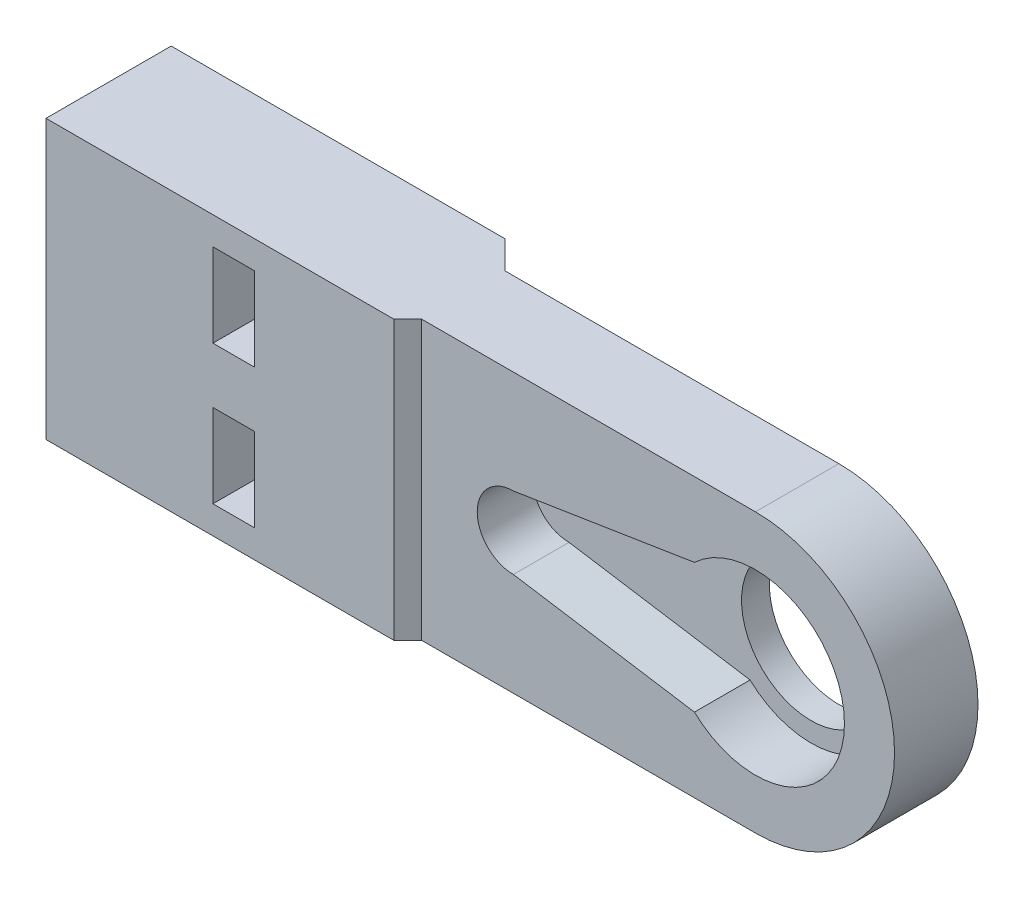
ISO-10303-21;
HEADER;
FILE_DESCRIPTION(('STEP AP214'),'2;1');
FILE_NAME('part.step','',(''),(''),'','','');
FILE_SCHEMA(('AUTOMOTIVE_DESIGN { 1 0 10303 214 1 1 1 1 }'));
ENDSEC;
DATA;
#1=APPLICATION_CONTEXT('core data for automotive mechanical design processes');
#2=APPLICATION_PROTOCOL_DEFINITION('international standard','automotive_design',2000,#1);
#3=PRODUCT_CONTEXT('',#1,'mechanical');
#4=PRODUCT('Part','Part','',(#3));
#5=PRODUCT_RELATED_PRODUCT_CATEGORY('part','',(#4));
#6=PRODUCT_DEFINITION_FORMATION('','',#4);
#7=PRODUCT_DEFINITION_CONTEXT('part definition',#1,'design');
#8=PRODUCT_DEFINITION('design','',#6,#7);
#9=PRODUCT_DEFINITION_SHAPE('','',#8);
#10=(LENGTH_UNIT() NAMED_UNIT(*) SI_UNIT(.MILLI.,.METRE.));
#11=(NAMED_UNIT(*) PLANE_ANGLE_UNIT() SI_UNIT($,.RADIAN.));
#12=(NAMED_UNIT(*) SI_UNIT($,.STERADIAN.) SOLID_ANGLE_UNIT());
#13=UNCERTAINTY_MEASURE_WITH_UNIT(LENGTH_MEASURE(1.E-05),#10,'distance_accuracy_value','');
#14=(GEOMETRIC_REPRESENTATION_CONTEXT(3) GLOBAL_UNCERTAINTY_ASSIGNED_CONTEXT((#13)) GLOBAL_UNIT_ASSIGNED_CONTEXT((#10,
#11,#12)) REPRESENTATION_CONTEXT('',''));
#15=CARTESIAN_POINT('',(0.,0.,0.));
#16=DIRECTION('',(0.,0.,1.));
#17=DIRECTION('',(1.,0.,0.));
#18=AXIS2_PLACEMENT_3D('',#15,#16,#17);
#19=CARTESIAN_POINT('',(-30.,5.,2.2));
#20=DIRECTION('',(-1.,0.,0.));
#21=DIRECTION('',(0.,0.,1.));
#22=AXIS2_PLACEMENT_3D('',#19,#20,#21);
#23=CYLINDRICAL_SURFACE('',#22,1.5);
#24=CARTESIAN_POINT('',(-38.,5.,2.2));
#25=DIRECTION('',(-1.,0.,0.));
#26=DIRECTION('',(0.,0.,1.));
#27=AXIS2_PLACEMENT_3D('',#24,#25,#26);
#28=CIRCLE('',#27,1.5);
#29=CARTESIAN_POINT('',(-38.,5.,3.7));
#30=VERTEX_POINT('',#29);
#31=EDGE_CURVE('E212',#30,#30,#28,.F.);
#32=ORIENTED_EDGE('',*,*,#31,.T.);
#33=EDGE_LOOP('',(#32));
#34=FACE_BOUND('',#33,.T.);
#35=CARTESIAN_POINT('',(-50.,5.,2.2));
#36=DIRECTION('',(-1.,0.,0.));
#37=DIRECTION('',(0.,0.,1.));
#38=AXIS2_PLACEMENT_3D('',#35,#36,#37);
#39=CIRCLE('',#38,1.5);
#40=CARTESIAN_POINT('',(-50.,5.,3.7));
#41=VERTEX_POINT('',#40);
#42=EDGE_CURVE('E294',#41,#41,#39,.T.);
#43=ORIENTED_EDGE('',*,*,#42,.T.);
#44=EDGE_LOOP('',(#43));
#45=FACE_BOUND('',#44,.T.);
#46=ADVANCED_FACE('F36',(#34,#45),#23,.F.);
#47=CARTESIAN_POINT('',(-30.,-5.,2.2));
#48=DIRECTION('',(-1.,0.,0.));
#49=DIRECTION('',(0.,0.,1.));
#50=AXIS2_PLACEMENT_3D('',#47,#48,#49);
#51=CYLINDRICAL_SURFACE('',#50,1.5);
#52=CARTESIAN_POINT('',(-38.,-5.,2.2));
#53=DIRECTION('',(-1.,0.,0.));
#54=DIRECTION('',(0.,0.,1.));
#55=AXIS2_PLACEMENT_3D('',#52,#53,#54);
#56=CIRCLE('',#55,1.5);
#57=CARTESIAN_POINT('',(-38.,-5.,3.7));
#58=VERTEX_POINT('',#57);
#59=EDGE_CURVE('E250',#58,#58,#56,.F.);
#60=ORIENTED_EDGE('',*,*,#59,.T.);
#61=EDGE_LOOP('',(#60));
#62=FACE_BOUND('',#61,.T.);
#63=CARTESIAN_POINT('',(-50.,-5.,2.2));
#64=DIRECTION('',(-1.,0.,0.));
#65=DIRECTION('',(0.,0.,1.));
#66=AXIS2_PLACEMENT_3D('',#63,#64,#65);
#67=CIRCLE('',#66,1.5);
#68=CARTESIAN_POINT('',(-50.,-5.,3.7));
#69=VERTEX_POINT('',#68);
#70=EDGE_CURVE('E290',#69,#69,#67,.T.);
#71=ORIENTED_EDGE('',*,*,#70,.T.);
#72=EDGE_LOOP('',(#71));
#73=FACE_BOUND('',#72,.T.);
#74=ADVANCED_FACE('F407',(#62,#73),#51,.F.);
#75=CARTESIAN_POINT('',(0.,0.,6.));
#76=DIRECTION('',(0.,0.,1.));
#77=DIRECTION('',(1.,0.,0.));
#78=AXIS2_PLACEMENT_3D('',#75,#76,#77);
#79=PLANE('',#78);
#80=DIRECTION('',(0.987688340595138,-0.156434465040231,0.));
#81=VECTOR('',#80,1.);
#82=CARTESIAN_POINT('',(-0.827530400919599,-5.22482132224575,6.));
#83=LINE('',#82,#81);
#84=CARTESIAN_POINT('',(-17.4,-2.6,6.));
#85=VERTEX_POINT('',#84);
#86=CARTESIAN_POINT('',(-4.38546232892651,-4.66130026511557,6.));
#87=VERTEX_POINT('',#86);
#88=EDGE_CURVE('E300',#85,#87,#83,.T.);
#89=ORIENTED_EDGE('',*,*,#88,.F.);
#90=CARTESIAN_POINT('',(-17.4,0.,6.));
#91=DIRECTION('',(0.,0.,1.));
#92=DIRECTION('',(1.,0.,0.));
#93=AXIS2_PLACEMENT_3D('',#90,#91,#92);
#94=CIRCLE('',#93,2.6);
#95=CARTESIAN_POINT('',(-17.4,2.6,6.));
#96=VERTEX_POINT('',#95);
#97=EDGE_CURVE('E307',#96,#85,#94,.T.);
#98=ORIENTED_EDGE('',*,*,#97,.F.);
#99=DIRECTION('',(0.987688340595138,0.156434465040232,0.));
#100=VECTOR('',#99,1.);
#101=CARTESIAN_POINT('',(-0.8275304009196,5.22482132224575,6.));
#102=LINE('',#101,#100);
#103=CARTESIAN_POINT('',(-4.3854623289265,4.66130026511558,6.));
#104=VERTEX_POINT('',#103);
#105=EDGE_CURVE('E323',#96,#104,#102,.T.);
#106=ORIENTED_EDGE('',*,*,#105,.T.);
#107=CARTESIAN_POINT('',(0.,0.,6.));
#108=DIRECTION('',(0.,0.,1.));
#109=DIRECTION('',(1.,0.,0.));
#110=AXIS2_PLACEMENT_3D('',#107,#108,#109);
#111=CIRCLE('',#110,6.4);
#112=EDGE_CURVE('E320',#87,#104,#111,.T.);
#113=ORIENTED_EDGE('',*,*,#112,.F.);
#114=EDGE_LOOP('',(#89,#98,#106,#113));
#115=FACE_BOUND('',#114,.T.);
#116=DIRECTION('',(-1.,0.,0.));
#117=VECTOR('',#116,1.);
#118=CARTESIAN_POINT('',(0.,10.,6.));
#119=LINE('',#118,#117);
#120=CARTESIAN_POINT('',(0.,10.,6.));
#121=VERTEX_POINT('',#120);
#122=CARTESIAN_POINT('',(-24.,10.,6.));
#123=VERTEX_POINT('',#122);
#124=EDGE_CURVE('E343',#121,#123,#119,.T.);
#125=ORIENTED_EDGE('',*,*,#124,.T.);
#126=DIRECTION('',(0.,-1.,0.));
#127=VECTOR('',#126,1.);
#128=CARTESIAN_POINT('',(-24.,10.,6.));
#129=LINE('',#128,#127);
#130=CARTESIAN_POINT('',(-24.,-10.,6.));
#131=VERTEX_POINT('',#130);
#132=EDGE_CURVE('E267',#123,#131,#129,.T.);
#133=ORIENTED_EDGE('',*,*,#132,.T.);
#134=DIRECTION('',(-1.,0.,0.));
#135=VECTOR('',#134,1.);
#136=CARTESIAN_POINT('',(0.,-10.,6.));
#137=LINE('',#136,#135);
#138=CARTESIAN_POINT('',(0.,-10.,6.));
#139=VERTEX_POINT('',#138);
#140=EDGE_CURVE('E337',#139,#131,#137,.T.);
#141=ORIENTED_EDGE('',*,*,#140,.F.);
#142=CARTESIAN_POINT('',(0.,0.,6.));
#143=DIRECTION('',(0.,0.,1.));
#144=DIRECTION('',(1.,0.,0.));
#145=AXIS2_PLACEMENT_3D('',#142,#143,#144);
#146=CIRCLE('',#145,10.);
#147=EDGE_CURVE('E340',#139,#121,#146,.T.);
#148=ORIENTED_EDGE('',*,*,#147,.T.);
#149=EDGE_LOOP('',(#125,#133,#141,#148));
#150=FACE_BOUND('',#149,.T.);
#151=ADVANCED_FACE('F382',(#115,#150),#79,.T.);
#152=CARTESIAN_POINT('',(0.,0.,0.));
#153=DIRECTION('',(0.,0.,1.));
#154=DIRECTION('',(1.,0.,0.));
#155=AXIS2_PLACEMENT_3D('',#152,#153,#154);
#156=PLANE('',#155);
#157=CARTESIAN_POINT('',(0.,0.,0.));
#158=DIRECTION('',(0.,0.,1.));
#159=DIRECTION('',(1.,0.,0.));
#160=AXIS2_PLACEMENT_3D('',#157,#158,#159);
#161=CIRCLE('',#160,5.);
#162=CARTESIAN_POINT('',(5.,0.,0.));
#163=VERTEX_POINT('',#162);
#164=EDGE_CURVE('E341',#163,#163,#161,.T.);
#165=ORIENTED_EDGE('',*,*,#164,.T.);
#166=EDGE_LOOP('',(#165));
#167=FACE_BOUND('',#166,.T.);
#168=DIRECTION('',(0.,-1.,0.));
#169=VECTOR('',#168,1.);
#170=CARTESIAN_POINT('',(-24.,10.,0.));
#171=LINE('',#170,#169);
#172=CARTESIAN_POINT('',(-24.,10.,0.));
#173=VERTEX_POINT('',#172);
#174=CARTESIAN_POINT('',(-24.,-10.,0.));
#175=VERTEX_POINT('',#174);
#176=EDGE_CURVE('E278',#173,#175,#171,.T.);
#177=ORIENTED_EDGE('',*,*,#176,.F.);
#178=DIRECTION('',(-1.,0.,0.));
#179=VECTOR('',#178,1.);
#180=CARTESIAN_POINT('',(0.,10.,0.));
#181=LINE('',#180,#179);
#182=CARTESIAN_POINT('',(0.,10.,0.));
#183=VERTEX_POINT('',#182);
#184=EDGE_CURVE('E350',#183,#173,#181,.T.);
#185=ORIENTED_EDGE('',*,*,#184,.F.);
#186=CARTESIAN_POINT('',(0.,0.,0.));
#187=DIRECTION('',(0.,0.,1.));
#188=DIRECTION('',(1.,0.,0.));
#189=AXIS2_PLACEMENT_3D('',#186,#187,#188);
#190=CIRCLE('',#189,10.);
#191=CARTESIAN_POINT('',(0.,-10.,0.));
#192=VERTEX_POINT('',#191);
#193=EDGE_CURVE('E348',#192,#183,#190,.T.);
#194=ORIENTED_EDGE('',*,*,#193,.F.);
#195=DIRECTION('',(-1.,0.,0.));
#196=VECTOR('',#195,1.);
#197=CARTESIAN_POINT('',(0.,-10.,0.));
#198=LINE('',#197,#196);
#199=EDGE_CURVE('E330',#192,#175,#198,.T.);
#200=ORIENTED_EDGE('',*,*,#199,.T.);
#201=EDGE_LOOP('',(#177,#185,#194,#200));
#202=FACE_BOUND('',#201,.T.);
#203=ADVANCED_FACE('F368',(#167,#202),#156,.F.);
#204=CARTESIAN_POINT('',(0.,0.,6.));
#205=DIRECTION('',(0.,0.,-1.));
#206=DIRECTION('',(-1.,0.,0.));
#207=AXIS2_PLACEMENT_3D('',#204,#205,#206);
#208=CYLINDRICAL_SURFACE('',#207,5.);
#209=ORIENTED_EDGE('',*,*,#164,.F.);
#210=EDGE_LOOP('',(#209));
#211=FACE_BOUND('',#210,.T.);
#212=CARTESIAN_POINT('',(0.,0.,2.));
#213=DIRECTION('',(0.,0.,1.));
#214=DIRECTION('',(1.,0.,0.));
#215=AXIS2_PLACEMENT_3D('',#212,#213,#214);
#216=CIRCLE('',#215,5.);
#217=CARTESIAN_POINT('',(5.,0.,2.));
#218=VERTEX_POINT('',#217);
#219=EDGE_CURVE('E315',#218,#218,#216,.F.);
#220=ORIENTED_EDGE('',*,*,#219,.F.);
#221=EDGE_LOOP('',(#220));
#222=FACE_BOUND('',#221,.T.);
#223=ADVANCED_FACE('F544',(#211,#222),#208,.F.);
#224=CARTESIAN_POINT('',(-50.,0.,6.));
#225=DIRECTION('',(1.,0.,0.));
#226=DIRECTION('',(0.,0.,-1.));
#227=AXIS2_PLACEMENT_3D('',#224,#225,#226);
#228=PLANE('',#227);
#229=ORIENTED_EDGE('',*,*,#70,.F.);
#230=EDGE_LOOP('',(#229));
#231=FACE_BOUND('',#230,.T.);
#232=ORIENTED_EDGE('',*,*,#42,.F.);
#233=EDGE_LOOP('',(#232));
#234=FACE_BOUND('',#233,.T.);
#235=DIRECTION('',(0.,0.,-1.));
#236=VECTOR('',#235,1.);
#237=CARTESIAN_POINT('',(-50.,10.,6.));
#238=LINE('',#237,#236);
#239=CARTESIAN_POINT('',(-50.,10.,7.));
#240=VERTEX_POINT('',#239);
#241=CARTESIAN_POINT('',(-50.,10.,-2.));
#242=VERTEX_POINT('',#241);
#243=EDGE_CURVE('E346',#240,#242,#238,.T.);
#244=ORIENTED_EDGE('',*,*,#243,.T.);
#245=DIRECTION('',(0.,-1.,0.));
#246=VECTOR('',#245,1.);
#247=CARTESIAN_POINT('',(-50.,10.,-2.));
#248=LINE('',#247,#246);
#249=CARTESIAN_POINT('',(-50.,-10.,-2.));
#250=VERTEX_POINT('',#249);
#251=EDGE_CURVE('E285',#242,#250,#248,.T.);
#252=ORIENTED_EDGE('',*,*,#251,.T.);
#253=DIRECTION('',(0.,0.,-1.));
#254=VECTOR('',#253,1.);
#255=CARTESIAN_POINT('',(-50.,-10.,6.));
#256=LINE('',#255,#254);
#257=CARTESIAN_POINT('',(-50.,-10.,7.));
#258=VERTEX_POINT('',#257);
#259=EDGE_CURVE('E11',#258,#250,#256,.T.);
#260=ORIENTED_EDGE('',*,*,#259,.F.);
#261=DIRECTION('',(0.,-1.,0.));
#262=VECTOR('',#261,1.);
#263=CARTESIAN_POINT('',(-50.,10.,7.));
#264=LINE('',#263,#262);
#265=EDGE_CURVE('E264',#240,#258,#264,.T.);
#266=ORIENTED_EDGE('',*,*,#265,.F.);
#267=EDGE_LOOP('',(#244,#252,#260,#266));
#268=FACE_BOUND('',#267,.T.);
#269=ADVANCED_FACE('F38',(#231,#234,#268),#228,.F.);
#270=CARTESIAN_POINT('',(0.,-10.,6.));
#271=DIRECTION('',(0.,-1.,0.));
#272=DIRECTION('',(0.,0.,-1.));
#273=AXIS2_PLACEMENT_3D('',#270,#271,#272);
#274=PLANE('',#273);
#275=ORIENTED_EDGE('',*,*,#199,.F.);
#276=DIRECTION('',(0.,0.,-1.));
#277=VECTOR('',#276,1.);
#278=CARTESIAN_POINT('',(0.,-10.,6.));
#279=LINE('',#278,#277);
#280=EDGE_CURVE('E44',#139,#192,#279,.T.);
#281=ORIENTED_EDGE('',*,*,#280,.F.);
#282=ORIENTED_EDGE('',*,*,#140,.T.);
#283=DIRECTION('',(0.707106781186547,0.,-0.707106781186549));
#284=VECTOR('',#283,1.);
#285=CARTESIAN_POINT('',(-9.00000000000002,-10.,-9.));
#286=LINE('',#285,#284);
#287=CARTESIAN_POINT('',(-25.,-10.,7.));
#288=VERTEX_POINT('',#287);
#289=EDGE_CURVE('E253',#288,#131,#286,.T.);
#290=ORIENTED_EDGE('',*,*,#289,.F.);
#291=DIRECTION('',(1.,0.,0.));
#292=VECTOR('',#291,1.);
#293=CARTESIAN_POINT('',(0.,-10.,7.));
#294=LINE('',#293,#292);
#295=EDGE_CURVE('E257',#258,#288,#294,.T.);
#296=ORIENTED_EDGE('',*,*,#295,.F.);
#297=ORIENTED_EDGE('',*,*,#259,.T.);
#298=DIRECTION('',(1.,0.,0.));
#299=VECTOR('',#298,1.);
#300=CARTESIAN_POINT('',(0.,-10.,-2.));
#301=LINE('',#300,#299);
#302=CARTESIAN_POINT('',(-26.,-10.,-2.));
#303=VERTEX_POINT('',#302);
#304=EDGE_CURVE('E275',#250,#303,#301,.T.);
#305=ORIENTED_EDGE('',*,*,#304,.T.);
#306=DIRECTION('',(0.707106781186551,0.,0.707106781186544));
#307=VECTOR('',#306,1.);
#308=CARTESIAN_POINT('',(-11.9999999999999,-10.,12.));
#309=LINE('',#308,#307);
#310=EDGE_CURVE('E270',#303,#175,#309,.T.);
#311=ORIENTED_EDGE('',*,*,#310,.T.);
#312=EDGE_LOOP('',(#275,#281,#282,#290,#296,#297,#305,#311));
#313=FACE_BOUND('',#312,.T.);
#314=ADVANCED_FACE('F369',(#313),#274,.T.);
#315=CARTESIAN_POINT('',(0.,0.,6.));
#316=DIRECTION('',(0.,0.,-1.));
#317=DIRECTION('',(-1.,0.,0.));
#318=AXIS2_PLACEMENT_3D('',#315,#316,#317);
#319=CYLINDRICAL_SURFACE('',#318,10.);
#320=ORIENTED_EDGE('',*,*,#193,.T.);
#321=DIRECTION('',(0.,0.,-1.));
#322=VECTOR('',#321,1.);
#323=CARTESIAN_POINT('',(0.,10.,6.));
#324=LINE('',#323,#322);
#325=EDGE_CURVE('E356',#121,#183,#324,.T.);
#326=ORIENTED_EDGE('',*,*,#325,.F.);
#327=ORIENTED_EDGE('',*,*,#147,.F.);
#328=ORIENTED_EDGE('',*,*,#280,.T.);
#329=EDGE_LOOP('',(#320,#326,#327,#328));
#330=FACE_BOUND('',#329,.T.);
#331=ADVANCED_FACE('F361',(#330),#319,.T.);
#332=CARTESIAN_POINT('',(0.,10.,6.));
#333=DIRECTION('',(0.,-1.,0.));
#334=DIRECTION('',(0.,0.,-1.));
#335=AXIS2_PLACEMENT_3D('',#332,#333,#334);
#336=PLANE('',#335);
#337=ORIENTED_EDGE('',*,*,#184,.T.);
#338=DIRECTION('',(0.707106781186551,0.,0.707106781186544));
#339=VECTOR('',#338,1.);
#340=CARTESIAN_POINT('',(-11.9999999999999,10.,12.));
#341=LINE('',#340,#339);
#342=CARTESIAN_POINT('',(-26.,10.,-2.));
#343=VERTEX_POINT('',#342);
#344=EDGE_CURVE('E271',#343,#173,#341,.T.);
#345=ORIENTED_EDGE('',*,*,#344,.F.);
#346=DIRECTION('',(1.,0.,0.));
#347=VECTOR('',#346,1.);
#348=CARTESIAN_POINT('',(0.,10.,-2.));
#349=LINE('',#348,#347);
#350=EDGE_CURVE('E274',#242,#343,#349,.T.);
#351=ORIENTED_EDGE('',*,*,#350,.F.);
#352=ORIENTED_EDGE('',*,*,#243,.F.);
#353=DIRECTION('',(1.,0.,0.));
#354=VECTOR('',#353,1.);
#355=CARTESIAN_POINT('',(0.,10.,7.));
#356=LINE('',#355,#354);
#357=CARTESIAN_POINT('',(-25.,10.,7.));
#358=VERTEX_POINT('',#357);
#359=EDGE_CURVE('E256',#240,#358,#356,.T.);
#360=ORIENTED_EDGE('',*,*,#359,.T.);
#361=DIRECTION('',(0.707106781186547,0.,-0.707106781186549));
#362=VECTOR('',#361,1.);
#363=CARTESIAN_POINT('',(-9.00000000000002,10.,-9.));
#364=LINE('',#363,#362);
#365=EDGE_CURVE('E254',#358,#123,#364,.T.);
#366=ORIENTED_EDGE('',*,*,#365,.T.);
#367=ORIENTED_EDGE('',*,*,#124,.F.);
#368=ORIENTED_EDGE('',*,*,#325,.T.);
#369=EDGE_LOOP('',(#337,#345,#351,#352,#360,#366,#367,#368));
#370=FACE_BOUND('',#369,.T.);
#371=ADVANCED_FACE('F376',(#370),#336,.F.);
#372=CARTESIAN_POINT('',(-0.827530400919599,-5.22482132224575,2.));
#373=DIRECTION('',(-0.156434465040231,-0.987688340595138,0.));
#374=DIRECTION('',(0.987688340595138,-0.156434465040231,0.));
#375=AXIS2_PLACEMENT_3D('',#372,#373,#374);
#376=PLANE('',#375);
#377=ORIENTED_EDGE('',*,*,#88,.T.);
#378=DIRECTION('',(0.,0.,1.));
#379=VECTOR('',#378,1.);
#380=CARTESIAN_POINT('',(-4.38546232892651,-4.66130026511557,2.));
#381=LINE('',#380,#379);
#382=CARTESIAN_POINT('',(-4.38546232892651,-4.66130026511557,2.));
#383=VERTEX_POINT('',#382);
#384=EDGE_CURVE('E318',#383,#87,#381,.T.);
#385=ORIENTED_EDGE('',*,*,#384,.F.);
#386=DIRECTION('',(0.987688340595138,-0.156434465040231,0.));
#387=VECTOR('',#386,1.);
#388=CARTESIAN_POINT('',(-0.827530400919599,-5.22482132224575,2.));
#389=LINE('',#388,#387);
#390=CARTESIAN_POINT('',(-17.4,-2.6,2.));
#391=VERTEX_POINT('',#390);
#392=EDGE_CURVE('E303',#391,#383,#389,.T.);
#393=ORIENTED_EDGE('',*,*,#392,.F.);
#394=DIRECTION('',(0.,0.,1.));
#395=VECTOR('',#394,1.);
#396=CARTESIAN_POINT('',(-17.4,-2.6,2.));
#397=LINE('',#396,#395);
#398=EDGE_CURVE('E328',#391,#85,#397,.T.);
#399=ORIENTED_EDGE('',*,*,#398,.T.);
#400=EDGE_LOOP('',(#377,#385,#393,#399));
#401=FACE_BOUND('',#400,.T.);
#402=ADVANCED_FACE('F592',(#401),#376,.F.);
#403=CARTESIAN_POINT('',(-17.4,0.,2.));
#404=DIRECTION('',(0.,0.,1.));
#405=DIRECTION('',(1.,0.,0.));
#406=AXIS2_PLACEMENT_3D('',#403,#404,#405);
#407=CYLINDRICAL_SURFACE('',#406,2.6);
#408=ORIENTED_EDGE('',*,*,#97,.T.);
#409=ORIENTED_EDGE('',*,*,#398,.F.);
#410=CARTESIAN_POINT('',(-17.4,0.,2.));
#411=DIRECTION('',(0.,0.,1.));
#412=DIRECTION('',(1.,0.,0.));
#413=AXIS2_PLACEMENT_3D('',#410,#411,#412);
#414=CIRCLE('',#413,2.6);
#415=CARTESIAN_POINT('',(-17.4,2.6,2.));
#416=VERTEX_POINT('',#415);
#417=EDGE_CURVE('E312',#416,#391,#414,.T.);
#418=ORIENTED_EDGE('',*,*,#417,.F.);
#419=DIRECTION('',(0.,0.,1.));
#420=VECTOR('',#419,1.);
#421=CARTESIAN_POINT('',(-17.4,2.6,2.));
#422=LINE('',#421,#420);
#423=EDGE_CURVE('E331',#416,#96,#422,.T.);
#424=ORIENTED_EDGE('',*,*,#423,.T.);
#425=EDGE_LOOP('',(#408,#409,#418,#424));
#426=FACE_BOUND('',#425,.T.);
#427=ADVANCED_FACE('F665',(#426),#407,.F.);
#428=CARTESIAN_POINT('',(-0.8275304009196,5.22482132224575,2.));
#429=DIRECTION('',(0.156434465040232,-0.987688340595138,0.));
#430=DIRECTION('',(0.987688340595138,0.156434465040232,0.));
#431=AXIS2_PLACEMENT_3D('',#428,#429,#430);
#432=PLANE('',#431);
#433=ORIENTED_EDGE('',*,*,#105,.F.);
#434=ORIENTED_EDGE('',*,*,#423,.F.);
#435=DIRECTION('',(0.987688340595138,0.156434465040232,0.));
#436=VECTOR('',#435,1.);
#437=CARTESIAN_POINT('',(-0.8275304009196,5.22482132224575,2.));
#438=LINE('',#437,#436);
#439=CARTESIAN_POINT('',(-4.3854623289265,4.66130026511558,2.));
#440=VERTEX_POINT('',#439);
#441=EDGE_CURVE('E310',#416,#440,#438,.T.);
#442=ORIENTED_EDGE('',*,*,#441,.T.);
#443=DIRECTION('',(0.,0.,1.));
#444=VECTOR('',#443,1.);
#445=CARTESIAN_POINT('',(-4.3854623289265,4.66130026511558,2.));
#446=LINE('',#445,#444);
#447=EDGE_CURVE('E333',#440,#104,#446,.T.);
#448=ORIENTED_EDGE('',*,*,#447,.T.);
#449=EDGE_LOOP('',(#433,#434,#442,#448));
#450=FACE_BOUND('',#449,.T.);
#451=ADVANCED_FACE('F674',(#450),#432,.T.);
#452=CARTESIAN_POINT('',(0.,0.,2.));
#453=DIRECTION('',(0.,0.,1.));
#454=DIRECTION('',(1.,0.,0.));
#455=AXIS2_PLACEMENT_3D('',#452,#453,#454);
#456=CYLINDRICAL_SURFACE('',#455,6.4);
#457=ORIENTED_EDGE('',*,*,#112,.T.);
#458=ORIENTED_EDGE('',*,*,#447,.F.);
#459=CARTESIAN_POINT('',(0.,0.,2.));
#460=DIRECTION('',(0.,0.,1.));
#461=DIRECTION('',(1.,0.,0.));
#462=AXIS2_PLACEMENT_3D('',#459,#460,#461);
#463=CIRCLE('',#462,6.4);
#464=EDGE_CURVE('E306',#383,#440,#463,.T.);
#465=ORIENTED_EDGE('',*,*,#464,.F.);
#466=ORIENTED_EDGE('',*,*,#384,.T.);
#467=EDGE_LOOP('',(#457,#458,#465,#466));
#468=FACE_BOUND('',#467,.T.);
#469=ADVANCED_FACE('F682',(#468),#456,.F.);
#470=CARTESIAN_POINT('',(0.,0.,2.));
#471=DIRECTION('',(0.,0.,1.));
#472=DIRECTION('',(1.,0.,0.));
#473=AXIS2_PLACEMENT_3D('',#470,#471,#472);
#474=PLANE('',#473);
#475=ORIENTED_EDGE('',*,*,#392,.T.);
#476=ORIENTED_EDGE('',*,*,#464,.T.);
#477=ORIENTED_EDGE('',*,*,#441,.F.);
#478=ORIENTED_EDGE('',*,*,#417,.T.);
#479=EDGE_LOOP('',(#475,#476,#477,#478));
#480=FACE_BOUND('',#479,.T.);
#481=ORIENTED_EDGE('',*,*,#219,.T.);
#482=EDGE_LOOP('',(#481));
#483=FACE_BOUND('',#482,.T.);
#484=ADVANCED_FACE('F403',(#480,#483),#474,.T.);
#485=CARTESIAN_POINT('',(-11.9999999999999,10.,12.));
#486=DIRECTION('',(0.707106781186544,0.,-0.707106781186551));
#487=DIRECTION('',(-0.707106781186551,0.,-0.707106781186544));
#488=AXIS2_PLACEMENT_3D('',#485,#486,#487);
#489=PLANE('',#488);
#490=ORIENTED_EDGE('',*,*,#310,.F.);
#491=DIRECTION('',(0.,-1.,0.));
#492=VECTOR('',#491,1.);
#493=CARTESIAN_POINT('',(-26.,10.,-2.));
#494=LINE('',#493,#492);
#495=EDGE_CURVE('E288',#343,#303,#494,.T.);
#496=ORIENTED_EDGE('',*,*,#495,.F.);
#497=ORIENTED_EDGE('',*,*,#344,.T.);
#498=ORIENTED_EDGE('',*,*,#176,.T.);
#499=EDGE_LOOP('',(#490,#496,#497,#498));
#500=FACE_BOUND('',#499,.T.);
#501=ADVANCED_FACE('F373',(#500),#489,.T.);
#502=CARTESIAN_POINT('',(0.,10.,-2.));
#503=DIRECTION('',(0.,0.,-1.));
#504=DIRECTION('',(-1.,0.,0.));
#505=AXIS2_PLACEMENT_3D('',#502,#503,#504);
#506=PLANE('',#505);
#507=DIRECTION('',(0.,1.,0.));
#508=VECTOR('',#507,1.);
#509=CARTESIAN_POINT('',(-38.,7.99999999999999,-2.));
#510=LINE('',#509,#508);
#511=CARTESIAN_POINT('',(-38.,1.99999999999999,-2.));
#512=VERTEX_POINT('',#511);
#513=CARTESIAN_POINT('',(-38.,7.99999999999999,-2.));
#514=VERTEX_POINT('',#513);
#515=EDGE_CURVE('E51',#512,#514,#510,.T.);
#516=ORIENTED_EDGE('',*,*,#515,.F.);
#517=DIRECTION('',(-1.,0.,0.));
#518=VECTOR('',#517,1.);
#519=CARTESIAN_POINT('',(-38.,1.99999999999999,-2.));
#520=LINE('',#519,#518);
#521=CARTESIAN_POINT('',(-35.,1.99999999999999,-2.));
#522=VERTEX_POINT('',#521);
#523=EDGE_CURVE('E191',#522,#512,#520,.T.);
#524=ORIENTED_EDGE('',*,*,#523,.F.);
#525=DIRECTION('',(0.,-1.,0.));
#526=VECTOR('',#525,1.);
#527=CARTESIAN_POINT('',(-35.,7.99999999999999,-2.));
#528=LINE('',#527,#526);
#529=CARTESIAN_POINT('',(-35.,7.99999999999999,-2.));
#530=VERTEX_POINT('',#529);
#531=EDGE_CURVE('E194',#530,#522,#528,.T.);
#532=ORIENTED_EDGE('',*,*,#531,.F.);
#533=DIRECTION('',(1.,0.,0.));
#534=VECTOR('',#533,1.);
#535=CARTESIAN_POINT('',(-38.,7.99999999999999,-2.));
#536=LINE('',#535,#534);
#537=EDGE_CURVE('E200',#514,#530,#536,.T.);
#538=ORIENTED_EDGE('',*,*,#537,.F.);
#539=EDGE_LOOP('',(#516,#524,#532,#538));
#540=FACE_BOUND('',#539,.T.);
#541=DIRECTION('',(0.,1.,0.));
#542=VECTOR('',#541,1.);
#543=CARTESIAN_POINT('',(-38.,-8.,-2.));
#544=LINE('',#543,#542);
#545=CARTESIAN_POINT('',(-38.,-8.,-2.));
#546=VERTEX_POINT('',#545);
#547=CARTESIAN_POINT('',(-38.,-2.,-2.));
#548=VERTEX_POINT('',#547);
#549=EDGE_CURVE('E215',#546,#548,#544,.T.);
#550=ORIENTED_EDGE('',*,*,#549,.F.);
#551=DIRECTION('',(-1.,0.,0.));
#552=VECTOR('',#551,1.);
#553=CARTESIAN_POINT('',(-38.,-8.,-2.));
#554=LINE('',#553,#552);
#555=CARTESIAN_POINT('',(-35.,-8.,-2.));
#556=VERTEX_POINT('',#555);
#557=EDGE_CURVE('E220',#556,#546,#554,.T.);
#558=ORIENTED_EDGE('',*,*,#557,.F.);
#559=DIRECTION('',(0.,-1.,0.));
#560=VECTOR('',#559,1.);
#561=CARTESIAN_POINT('',(-35.,-8.,-2.));
#562=LINE('',#561,#560);
#563=CARTESIAN_POINT('',(-35.,-2.,-2.));
#564=VERTEX_POINT('',#563);
#565=EDGE_CURVE('E234',#564,#556,#562,.T.);
#566=ORIENTED_EDGE('',*,*,#565,.F.);
#567=DIRECTION('',(1.,0.,0.));
#568=VECTOR('',#567,1.);
#569=CARTESIAN_POINT('',(-38.,-2.,-2.));
#570=LINE('',#569,#568);
#571=EDGE_CURVE('E231',#548,#564,#570,.T.);
#572=ORIENTED_EDGE('',*,*,#571,.F.);
#573=EDGE_LOOP('',(#550,#558,#566,#572));
#574=FACE_BOUND('',#573,.T.);
#575=ORIENTED_EDGE('',*,*,#304,.F.);
#576=ORIENTED_EDGE('',*,*,#251,.F.);
#577=ORIENTED_EDGE('',*,*,#350,.T.);
#578=ORIENTED_EDGE('',*,*,#495,.T.);
#579=EDGE_LOOP('',(#575,#576,#577,#578));
#580=FACE_BOUND('',#579,.T.);
#581=ADVANCED_FACE('F394',(#540,#574,#580),#506,.T.);
#582=CARTESIAN_POINT('',(-9.00000000000002,10.,-9.));
#583=DIRECTION('',(-0.707106781186549,0.,-0.707106781186547));
#584=DIRECTION('',(-0.707106781186547,0.,0.707106781186549));
#585=AXIS2_PLACEMENT_3D('',#582,#583,#584);
#586=PLANE('',#585);
#587=ORIENTED_EDGE('',*,*,#289,.T.);
#588=ORIENTED_EDGE('',*,*,#132,.F.);
#589=ORIENTED_EDGE('',*,*,#365,.F.);
#590=DIRECTION('',(0.,-1.,0.));
#591=VECTOR('',#590,1.);
#592=CARTESIAN_POINT('',(-25.,10.,7.));
#593=LINE('',#592,#591);
#594=EDGE_CURVE('E259',#358,#288,#593,.T.);
#595=ORIENTED_EDGE('',*,*,#594,.T.);
#596=EDGE_LOOP('',(#587,#588,#589,#595));
#597=FACE_BOUND('',#596,.T.);
#598=ADVANCED_FACE('F386',(#597),#586,.F.);
#599=CARTESIAN_POINT('',(0.,10.,7.));
#600=DIRECTION('',(0.,0.,-1.));
#601=DIRECTION('',(-1.,0.,0.));
#602=AXIS2_PLACEMENT_3D('',#599,#600,#601);
#603=PLANE('',#602);
#604=DIRECTION('',(-1.,0.,0.));
#605=VECTOR('',#604,1.);
#606=CARTESIAN_POINT('',(-38.,1.99999999999999,7.));
#607=LINE('',#606,#605);
#608=CARTESIAN_POINT('',(-35.,1.99999999999999,7.));
#609=VERTEX_POINT('',#608);
#610=CARTESIAN_POINT('',(-38.,1.99999999999999,7.));
#611=VERTEX_POINT('',#610);
#612=EDGE_CURVE('E181',#609,#611,#607,.T.);
#613=ORIENTED_EDGE('',*,*,#612,.T.);
#614=DIRECTION('',(0.,1.,0.));
#615=VECTOR('',#614,1.);
#616=CARTESIAN_POINT('',(-38.,7.99999999999999,7.));
#617=LINE('',#616,#615);
#618=CARTESIAN_POINT('',(-38.,7.99999999999999,7.));
#619=VERTEX_POINT('',#618);
#620=EDGE_CURVE('E175',#611,#619,#617,.T.);
#621=ORIENTED_EDGE('',*,*,#620,.T.);
#622=DIRECTION('',(1.,0.,0.));
#623=VECTOR('',#622,1.);
#624=CARTESIAN_POINT('',(-38.,7.99999999999999,7.));
#625=LINE('',#624,#623);
#626=CARTESIAN_POINT('',(-35.,7.99999999999999,7.));
#627=VERTEX_POINT('',#626);
#628=EDGE_CURVE('E184',#619,#627,#625,.T.);
#629=ORIENTED_EDGE('',*,*,#628,.T.);
#630=DIRECTION('',(0.,-1.,0.));
#631=VECTOR('',#630,1.);
#632=CARTESIAN_POINT('',(-35.,7.99999999999999,7.));
#633=LINE('',#632,#631);
#634=EDGE_CURVE('E59',#627,#609,#633,.T.);
#635=ORIENTED_EDGE('',*,*,#634,.T.);
#636=EDGE_LOOP('',(#613,#621,#629,#635));
#637=FACE_BOUND('',#636,.T.);
#638=DIRECTION('',(-1.,0.,0.));
#639=VECTOR('',#638,1.);
#640=CARTESIAN_POINT('',(-38.,-8.,7.));
#641=LINE('',#640,#639);
#642=CARTESIAN_POINT('',(-35.,-8.,7.));
#643=VERTEX_POINT('',#642);
#644=CARTESIAN_POINT('',(-38.,-8.,7.));
#645=VERTEX_POINT('',#644);
#646=EDGE_CURVE('E226',#643,#645,#641,.T.);
#647=ORIENTED_EDGE('',*,*,#646,.T.);
#648=DIRECTION('',(0.,1.,0.));
#649=VECTOR('',#648,1.);
#650=CARTESIAN_POINT('',(-38.,-8.,7.));
#651=LINE('',#650,#649);
#652=CARTESIAN_POINT('',(-38.,-2.,7.));
#653=VERTEX_POINT('',#652);
#654=EDGE_CURVE('E216',#645,#653,#651,.T.);
#655=ORIENTED_EDGE('',*,*,#654,.T.);
#656=DIRECTION('',(1.,0.,0.));
#657=VECTOR('',#656,1.);
#658=CARTESIAN_POINT('',(-38.,-2.,7.));
#659=LINE('',#658,#657);
#660=CARTESIAN_POINT('',(-35.,-2.,7.));
#661=VERTEX_POINT('',#660);
#662=EDGE_CURVE('E219',#653,#661,#659,.T.);
#663=ORIENTED_EDGE('',*,*,#662,.T.);
#664=DIRECTION('',(0.,-1.,0.));
#665=VECTOR('',#664,1.);
#666=CARTESIAN_POINT('',(-35.,-8.,7.));
#667=LINE('',#666,#665);
#668=EDGE_CURVE('E223',#661,#643,#667,.T.);
#669=ORIENTED_EDGE('',*,*,#668,.T.);
#670=EDGE_LOOP('',(#647,#655,#663,#669));
#671=FACE_BOUND('',#670,.T.);
#672=ORIENTED_EDGE('',*,*,#295,.T.);
#673=ORIENTED_EDGE('',*,*,#594,.F.);
#674=ORIENTED_EDGE('',*,*,#359,.F.);
#675=ORIENTED_EDGE('',*,*,#265,.T.);
#676=EDGE_LOOP('',(#672,#673,#674,#675));
#677=FACE_BOUND('',#676,.T.);
#678=ADVANCED_FACE('F188',(#637,#671,#677),#603,.F.);
#679=CARTESIAN_POINT('',(-38.,-8.,7.));
#680=DIRECTION('',(-1.,0.,0.));
#681=DIRECTION('',(0.,0.,1.));
#682=AXIS2_PLACEMENT_3D('',#679,#680,#681);
#683=PLANE('',#682);
#684=ORIENTED_EDGE('',*,*,#549,.T.);
#685=DIRECTION('',(0.,0.,-1.));
#686=VECTOR('',#685,1.);
#687=CARTESIAN_POINT('',(-38.,-2.,7.));
#688=LINE('',#687,#686);
#689=EDGE_CURVE('E229',#653,#548,#688,.T.);
#690=ORIENTED_EDGE('',*,*,#689,.F.);
#691=ORIENTED_EDGE('',*,*,#654,.F.);
#692=DIRECTION('',(0.,0.,-1.));
#693=VECTOR('',#692,1.);
#694=CARTESIAN_POINT('',(-38.,-8.,7.));
#695=LINE('',#694,#693);
#696=EDGE_CURVE('E239',#645,#546,#695,.T.);
#697=ORIENTED_EDGE('',*,*,#696,.T.);
#698=EDGE_LOOP('',(#684,#690,#691,#697));
#699=FACE_BOUND('',#698,.T.);
#700=ORIENTED_EDGE('',*,*,#59,.F.);
#701=EDGE_LOOP('',(#700));
#702=FACE_BOUND('',#701,.T.);
#703=ADVANCED_FACE('F453',(#699,#702),#683,.F.);
#704=CARTESIAN_POINT('',(-35.,-8.,7.));
#705=DIRECTION('',(1.,0.,0.));
#706=DIRECTION('',(0.,0.,-1.));
#707=AXIS2_PLACEMENT_3D('',#704,#705,#706);
#708=PLANE('',#707);
#709=ORIENTED_EDGE('',*,*,#565,.T.);
#710=DIRECTION('',(0.,0.,-1.));
#711=VECTOR('',#710,1.);
#712=CARTESIAN_POINT('',(-35.,-8.,7.));
#713=LINE('',#712,#711);
#714=EDGE_CURVE('E242',#643,#556,#713,.T.);
#715=ORIENTED_EDGE('',*,*,#714,.F.);
#716=ORIENTED_EDGE('',*,*,#668,.F.);
#717=DIRECTION('',(0.,0.,-1.));
#718=VECTOR('',#717,1.);
#719=CARTESIAN_POINT('',(-35.,-2.,7.));
#720=LINE('',#719,#718);
#721=EDGE_CURVE('E244',#661,#564,#720,.T.);
#722=ORIENTED_EDGE('',*,*,#721,.T.);
#723=EDGE_LOOP('',(#709,#715,#716,#722));
#724=FACE_BOUND('',#723,.T.);
#725=CARTESIAN_POINT('',(-35.,-5.,2.2));
#726=DIRECTION('',(1.,0.,0.));
#727=DIRECTION('',(0.,0.,-1.));
#728=AXIS2_PLACEMENT_3D('',#725,#726,#727);
#729=CIRCLE('',#728,1.5);
#730=CARTESIAN_POINT('',(-35.,-5.,0.700000000000002));
#731=VERTEX_POINT('',#730);
#732=EDGE_CURVE('E241',#731,#731,#729,.F.);
#733=ORIENTED_EDGE('',*,*,#732,.F.);
#734=EDGE_LOOP('',(#733));
#735=FACE_BOUND('',#734,.T.);
#736=ADVANCED_FACE('F449',(#724,#735),#708,.F.);
#737=CARTESIAN_POINT('',(-38.,-8.,7.));
#738=DIRECTION('',(0.,-1.,0.));
#739=DIRECTION('',(0.,0.,-1.));
#740=AXIS2_PLACEMENT_3D('',#737,#738,#739);
#741=PLANE('',#740);
#742=ORIENTED_EDGE('',*,*,#557,.T.);
#743=ORIENTED_EDGE('',*,*,#696,.F.);
#744=ORIENTED_EDGE('',*,*,#646,.F.);
#745=ORIENTED_EDGE('',*,*,#714,.T.);
#746=EDGE_LOOP('',(#742,#743,#744,#745));
#747=FACE_BOUND('',#746,.T.);
#748=ADVANCED_FACE('F445',(#747),#741,.F.);
#749=CARTESIAN_POINT('',(-38.,-2.,7.));
#750=DIRECTION('',(0.,1.,0.));
#751=DIRECTION('',(0.,0.,1.));
#752=AXIS2_PLACEMENT_3D('',#749,#750,#751);
#753=PLANE('',#752);
#754=ORIENTED_EDGE('',*,*,#571,.T.);
#755=ORIENTED_EDGE('',*,*,#721,.F.);
#756=ORIENTED_EDGE('',*,*,#662,.F.);
#757=ORIENTED_EDGE('',*,*,#689,.T.);
#758=EDGE_LOOP('',(#754,#755,#756,#757));
#759=FACE_BOUND('',#758,.T.);
#760=ADVANCED_FACE('F448',(#759),#753,.F.);
#761=CARTESIAN_POINT('',(-30.,0.,0.));
#762=DIRECTION('',(-1.,0.,0.));
#763=DIRECTION('',(0.,0.,1.));
#764=AXIS2_PLACEMENT_3D('',#761,#762,#763);
#765=PLANE('',#764);
#766=CARTESIAN_POINT('',(-30.,-5.,2.2));
#767=DIRECTION('',(-1.,0.,0.));
#768=DIRECTION('',(0.,0.,1.));
#769=AXIS2_PLACEMENT_3D('',#766,#767,#768);
#770=CIRCLE('',#769,1.5);
#771=CARTESIAN_POINT('',(-30.,-5.,3.7));
#772=VERTEX_POINT('',#771);
#773=EDGE_CURVE('E291',#772,#772,#770,.T.);
#774=ORIENTED_EDGE('',*,*,#773,.T.);
#775=EDGE_LOOP('',(#774));
#776=FACE_BOUND('',#775,.T.);
#777=ADVANCED_FACE('F457',(#776),#765,.T.);
#778=ORIENTED_EDGE('',*,*,#732,.T.);
#779=EDGE_LOOP('',(#778));
#780=FACE_BOUND('',#779,.T.);
#781=ORIENTED_EDGE('',*,*,#773,.F.);
#782=EDGE_LOOP('',(#781));
#783=FACE_BOUND('',#782,.T.);
#784=ADVANCED_FACE('F416',(#780,#783),#51,.F.);
#785=CARTESIAN_POINT('',(-38.,7.99999999999999,7.));
#786=DIRECTION('',(-1.,0.,0.));
#787=DIRECTION('',(0.,0.,1.));
#788=AXIS2_PLACEMENT_3D('',#785,#786,#787);
#789=PLANE('',#788);
#790=ORIENTED_EDGE('',*,*,#515,.T.);
#791=DIRECTION('',(0.,0.,-1.));
#792=VECTOR('',#791,1.);
#793=CARTESIAN_POINT('',(-38.,7.99999999999999,7.));
#794=LINE('',#793,#792);
#795=EDGE_CURVE('E170',#619,#514,#794,.T.);
#796=ORIENTED_EDGE('',*,*,#795,.F.);
#797=ORIENTED_EDGE('',*,*,#620,.F.);
#798=DIRECTION('',(0.,0.,-1.));
#799=VECTOR('',#798,1.);
#800=CARTESIAN_POINT('',(-38.,1.99999999999999,7.));
#801=LINE('',#800,#799);
#802=EDGE_CURVE('E204',#611,#512,#801,.T.);
#803=ORIENTED_EDGE('',*,*,#802,.T.);
#804=EDGE_LOOP('',(#790,#796,#797,#803));
#805=FACE_BOUND('',#804,.T.);
#806=ORIENTED_EDGE('',*,*,#31,.F.);
#807=EDGE_LOOP('',(#806));
#808=FACE_BOUND('',#807,.T.);
#809=ADVANCED_FACE('F172',(#805,#808),#789,.F.);
#810=CARTESIAN_POINT('',(-35.,7.99999999999999,7.));
#811=DIRECTION('',(1.,0.,0.));
#812=DIRECTION('',(0.,0.,-1.));
#813=AXIS2_PLACEMENT_3D('',#810,#811,#812);
#814=PLANE('',#813);
#815=ORIENTED_EDGE('',*,*,#531,.T.);
#816=DIRECTION('',(0.,0.,-1.));
#817=VECTOR('',#816,1.);
#818=CARTESIAN_POINT('',(-35.,1.99999999999999,7.));
#819=LINE('',#818,#817);
#820=EDGE_CURVE('E207',#609,#522,#819,.T.);
#821=ORIENTED_EDGE('',*,*,#820,.F.);
#822=ORIENTED_EDGE('',*,*,#634,.F.);
#823=DIRECTION('',(0.,0.,-1.));
#824=VECTOR('',#823,1.);
#825=CARTESIAN_POINT('',(-35.,7.99999999999999,7.));
#826=LINE('',#825,#824);
#827=EDGE_CURVE('E180',#627,#530,#826,.T.);
#828=ORIENTED_EDGE('',*,*,#827,.T.);
#829=EDGE_LOOP('',(#815,#821,#822,#828));
#830=FACE_BOUND('',#829,.T.);
#831=CARTESIAN_POINT('',(-35.,5.,2.2));
#832=DIRECTION('',(1.,0.,0.));
#833=DIRECTION('',(0.,0.,-1.));
#834=AXIS2_PLACEMENT_3D('',#831,#832,#833);
#835=CIRCLE('',#834,1.5);
#836=CARTESIAN_POINT('',(-35.,5.,0.700000000000002));
#837=VERTEX_POINT('',#836);
#838=EDGE_CURVE('E206',#837,#837,#835,.F.);
#839=ORIENTED_EDGE('',*,*,#838,.F.);
#840=EDGE_LOOP('',(#839));
#841=FACE_BOUND('',#840,.T.);
#842=ADVANCED_FACE('F431',(#830,#841),#814,.F.);
#843=CARTESIAN_POINT('',(-38.,1.99999999999999,7.));
#844=DIRECTION('',(0.,-1.,0.));
#845=DIRECTION('',(1.,0.,0.));
#846=AXIS2_PLACEMENT_3D('',#843,#844,#845);
#847=PLANE('',#846);
#848=ORIENTED_EDGE('',*,*,#523,.T.);
#849=ORIENTED_EDGE('',*,*,#802,.F.);
#850=ORIENTED_EDGE('',*,*,#612,.F.);
#851=ORIENTED_EDGE('',*,*,#820,.T.);
#852=EDGE_LOOP('',(#848,#849,#850,#851));
#853=FACE_BOUND('',#852,.T.);
#854=ADVANCED_FACE('F433',(#853),#847,.F.);
#855=CARTESIAN_POINT('',(-38.,7.99999999999999,7.));
#856=DIRECTION('',(0.,1.,0.));
#857=DIRECTION('',(0.,0.,1.));
#858=AXIS2_PLACEMENT_3D('',#855,#856,#857);
#859=PLANE('',#858);
#860=ORIENTED_EDGE('',*,*,#537,.T.);
#861=ORIENTED_EDGE('',*,*,#827,.F.);
#862=ORIENTED_EDGE('',*,*,#628,.F.);
#863=ORIENTED_EDGE('',*,*,#795,.T.);
#864=EDGE_LOOP('',(#860,#861,#862,#863));
#865=FACE_BOUND('',#864,.T.);
#866=ADVANCED_FACE('F185',(#865),#859,.F.);
#867=CARTESIAN_POINT('',(-30.,0.,0.));
#868=DIRECTION('',(-1.,0.,0.));
#869=DIRECTION('',(0.,0.,1.));
#870=AXIS2_PLACEMENT_3D('',#867,#868,#869);
#871=PLANE('',#870);
#872=CARTESIAN_POINT('',(-30.,5.,2.2));
#873=DIRECTION('',(-1.,0.,0.));
#874=DIRECTION('',(0.,0.,1.));
#875=AXIS2_PLACEMENT_3D('',#872,#873,#874);
#876=CIRCLE('',#875,1.5);
#877=CARTESIAN_POINT('',(-30.,5.,3.7));
#878=VERTEX_POINT('',#877);
#879=EDGE_CURVE('E297',#878,#878,#876,.T.);
#880=ORIENTED_EDGE('',*,*,#879,.T.);
#881=EDGE_LOOP('',(#880));
#882=FACE_BOUND('',#881,.T.);
#883=ADVANCED_FACE('F421',(#882),#871,.T.);
#884=ORIENTED_EDGE('',*,*,#838,.T.);
#885=EDGE_LOOP('',(#884));
#886=FACE_BOUND('',#885,.T.);
#887=ORIENTED_EDGE('',*,*,#879,.F.);
#888=EDGE_LOOP('',(#887));
#889=FACE_BOUND('',#888,.T.);
#890=ADVANCED_FACE('F410',(#886,#889),#23,.F.);
#891=CLOSED_SHELL('',(#46,#74,#151,#203,#223,#269,#314,#331,#371,#402,#427,#451,#469,#484,#501,
#581,#598,#678,#703,#736,#748,#760,#777,#784,#809,#842,#854,#866,#883,#890));
#892=MANIFOLD_SOLID_BREP('B2',#891);
#893=ADVANCED_BREP_SHAPE_REPRESENTATION('',(#18,#892),#14);
#894=SHAPE_DEFINITION_REPRESENTATION(#9,#893);
ENDSEC;
END-ISO-10303-21;
